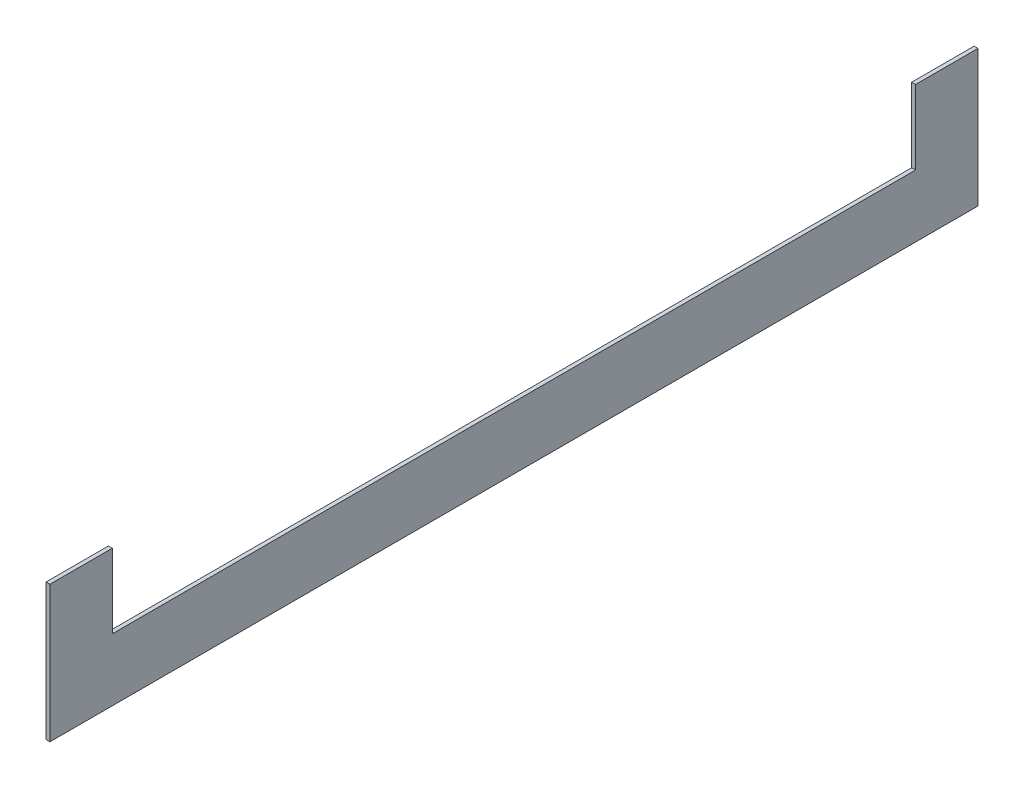
ISO-10303-21;
HEADER;
FILE_DESCRIPTION(('STEP AP214'),'2;1');
FILE_NAME('part.step','',(''),(''),'','','');
FILE_SCHEMA(('AUTOMOTIVE_DESIGN { 1 0 10303 214 1 1 1 1 }'));
ENDSEC;
DATA;
#1=APPLICATION_CONTEXT('core data for automotive mechanical design processes');
#2=APPLICATION_PROTOCOL_DEFINITION('international standard','automotive_design',2000,#1);
#3=PRODUCT_CONTEXT('',#1,'mechanical');
#4=PRODUCT('Part','Part','',(#3));
#5=PRODUCT_RELATED_PRODUCT_CATEGORY('part','',(#4));
#6=PRODUCT_DEFINITION_FORMATION('','',#4);
#7=PRODUCT_DEFINITION_CONTEXT('part definition',#1,'design');
#8=PRODUCT_DEFINITION('design','',#6,#7);
#9=PRODUCT_DEFINITION_SHAPE('','',#8);
#10=(LENGTH_UNIT() NAMED_UNIT(*) SI_UNIT(.MILLI.,.METRE.));
#11=(NAMED_UNIT(*) PLANE_ANGLE_UNIT() SI_UNIT($,.RADIAN.));
#12=(NAMED_UNIT(*) SI_UNIT($,.STERADIAN.) SOLID_ANGLE_UNIT());
#13=UNCERTAINTY_MEASURE_WITH_UNIT(LENGTH_MEASURE(1.E-05),#10,'distance_accuracy_value','');
#14=(GEOMETRIC_REPRESENTATION_CONTEXT(3) GLOBAL_UNCERTAINTY_ASSIGNED_CONTEXT((#13)) GLOBAL_UNIT_ASSIGNED_CONTEXT((#10,
#11,#12)) REPRESENTATION_CONTEXT('',''));
#15=CARTESIAN_POINT('',(0.,0.,0.));
#16=DIRECTION('',(0.,0.,1.));
#17=DIRECTION('',(1.,0.,0.));
#18=AXIS2_PLACEMENT_3D('',#15,#16,#17);
#19=CARTESIAN_POINT('',(3.175,0.,377.825));
#20=DIRECTION('',(0.,0.,-1.));
#21=DIRECTION('',(-1.,0.,0.));
#22=AXIS2_PLACEMENT_3D('',#19,#20,#21);
#23=PLANE('',#22);
#24=DIRECTION('',(0.,-1.,0.));
#25=VECTOR('',#24,1.);
#26=CARTESIAN_POINT('',(0.,0.,377.825));
#27=LINE('',#26,#25);
#28=CARTESIAN_POINT('',(0.,111.125,377.825));
#29=VERTEX_POINT('',#28);
#30=CARTESIAN_POINT('',(0.,0.,377.825));
#31=VERTEX_POINT('',#30);
#32=EDGE_CURVE('E129',#29,#31,#27,.T.);
#33=ORIENTED_EDGE('',*,*,#32,.T.);
#34=DIRECTION('',(-1.,0.,0.));
#35=VECTOR('',#34,1.);
#36=CARTESIAN_POINT('',(3.175,0.,377.825));
#37=LINE('',#36,#35);
#38=CARTESIAN_POINT('',(3.175,0.,377.825));
#39=VERTEX_POINT('',#38);
#40=EDGE_CURVE('E11',#39,#31,#37,.T.);
#41=ORIENTED_EDGE('',*,*,#40,.F.);
#42=DIRECTION('',(0.,-1.,0.));
#43=VECTOR('',#42,1.);
#44=CARTESIAN_POINT('',(3.175,0.,377.825));
#45=LINE('',#44,#43);
#46=CARTESIAN_POINT('',(3.175,111.125,377.825));
#47=VERTEX_POINT('',#46);
#48=EDGE_CURVE('E143',#47,#39,#45,.T.);
#49=ORIENTED_EDGE('',*,*,#48,.F.);
#50=DIRECTION('',(-1.,0.,0.));
#51=VECTOR('',#50,1.);
#52=CARTESIAN_POINT('',(3.175,111.125,377.825));
#53=LINE('',#52,#51);
#54=EDGE_CURVE('E125',#47,#29,#53,.T.);
#55=ORIENTED_EDGE('',*,*,#54,.T.);
#56=EDGE_LOOP('',(#33,#41,#49,#55));
#57=FACE_BOUND('',#56,.T.);
#58=ADVANCED_FACE('F33',(#57),#23,.F.);
#59=CARTESIAN_POINT('',(3.175,0.,377.825));
#60=DIRECTION('',(0.,1.,0.));
#61=DIRECTION('',(0.,0.,1.));
#62=AXIS2_PLACEMENT_3D('',#59,#60,#61);
#63=PLANE('',#62);
#64=DIRECTION('',(0.,0.,-1.));
#65=VECTOR('',#64,1.);
#66=CARTESIAN_POINT('',(0.,0.,377.825));
#67=LINE('',#66,#65);
#68=CARTESIAN_POINT('',(0.,1.3903822314399E-13,-377.825));
#69=VERTEX_POINT('',#68);
#70=EDGE_CURVE('E132',#31,#69,#67,.T.);
#71=ORIENTED_EDGE('',*,*,#70,.T.);
#72=DIRECTION('',(-1.,0.,0.));
#73=VECTOR('',#72,1.);
#74=CARTESIAN_POINT('',(3.175,1.3903822314399E-13,-377.825));
#75=LINE('',#74,#73);
#76=CARTESIAN_POINT('',(3.175,1.3903822314399E-13,-377.825));
#77=VERTEX_POINT('',#76);
#78=EDGE_CURVE('E41',#77,#69,#75,.T.);
#79=ORIENTED_EDGE('',*,*,#78,.F.);
#80=DIRECTION('',(0.,0.,-1.));
#81=VECTOR('',#80,1.);
#82=CARTESIAN_POINT('',(3.175,0.,377.825));
#83=LINE('',#82,#81);
#84=EDGE_CURVE('E92',#39,#77,#83,.T.);
#85=ORIENTED_EDGE('',*,*,#84,.F.);
#86=ORIENTED_EDGE('',*,*,#40,.T.);
#87=EDGE_LOOP('',(#71,#79,#85,#86));
#88=FACE_BOUND('',#87,.T.);
#89=ADVANCED_FACE('F178',(#88),#63,.F.);
#90=CARTESIAN_POINT('',(3.175,111.125,-377.825));
#91=DIRECTION('',(0.,0.,1.));
#92=DIRECTION('',(1.,0.,0.));
#93=AXIS2_PLACEMENT_3D('',#90,#91,#92);
#94=PLANE('',#93);
#95=DIRECTION('',(0.,1.,0.));
#96=VECTOR('',#95,1.);
#97=CARTESIAN_POINT('',(0.,111.125,-377.825));
#98=LINE('',#97,#96);
#99=CARTESIAN_POINT('',(0.,111.125,-377.825));
#100=VERTEX_POINT('',#99);
#101=EDGE_CURVE('E134',#69,#100,#98,.T.);
#102=ORIENTED_EDGE('',*,*,#101,.T.);
#103=DIRECTION('',(-1.,0.,0.));
#104=VECTOR('',#103,1.);
#105=CARTESIAN_POINT('',(3.175,111.125,-377.825));
#106=LINE('',#105,#104);
#107=CARTESIAN_POINT('',(3.175,111.125,-377.825));
#108=VERTEX_POINT('',#107);
#109=EDGE_CURVE('E150',#108,#100,#106,.T.);
#110=ORIENTED_EDGE('',*,*,#109,.F.);
#111=DIRECTION('',(0.,1.,0.));
#112=VECTOR('',#111,1.);
#113=CARTESIAN_POINT('',(3.175,111.125,-377.825));
#114=LINE('',#113,#112);
#115=EDGE_CURVE('E158',#77,#108,#114,.T.);
#116=ORIENTED_EDGE('',*,*,#115,.F.);
#117=ORIENTED_EDGE('',*,*,#78,.T.);
#118=EDGE_LOOP('',(#102,#110,#116,#117));
#119=FACE_BOUND('',#118,.T.);
#120=ADVANCED_FACE('F156',(#119),#94,.F.);
#121=CARTESIAN_POINT('',(3.175,111.125,-327.025));
#122=DIRECTION('',(0.,-1.,0.));
#123=DIRECTION('',(0.,0.,-1.));
#124=AXIS2_PLACEMENT_3D('',#121,#122,#123);
#125=PLANE('',#124);
#126=DIRECTION('',(0.,0.,1.));
#127=VECTOR('',#126,1.);
#128=CARTESIAN_POINT('',(0.,111.125,-327.025));
#129=LINE('',#128,#127);
#130=CARTESIAN_POINT('',(0.,111.125,-327.025));
#131=VERTEX_POINT('',#130);
#132=EDGE_CURVE('E136',#100,#131,#129,.T.);
#133=ORIENTED_EDGE('',*,*,#132,.T.);
#134=DIRECTION('',(-1.,0.,0.));
#135=VECTOR('',#134,1.);
#136=CARTESIAN_POINT('',(3.175,111.125,-327.025));
#137=LINE('',#136,#135);
#138=CARTESIAN_POINT('',(3.175,111.125,-327.025));
#139=VERTEX_POINT('',#138);
#140=EDGE_CURVE('E147',#139,#131,#137,.T.);
#141=ORIENTED_EDGE('',*,*,#140,.F.);
#142=DIRECTION('',(0.,0.,1.));
#143=VECTOR('',#142,1.);
#144=CARTESIAN_POINT('',(3.175,111.125,-327.025));
#145=LINE('',#144,#143);
#146=EDGE_CURVE('E170',#108,#139,#145,.T.);
#147=ORIENTED_EDGE('',*,*,#146,.F.);
#148=ORIENTED_EDGE('',*,*,#109,.T.);
#149=EDGE_LOOP('',(#133,#141,#147,#148));
#150=FACE_BOUND('',#149,.T.);
#151=ADVANCED_FACE('F166',(#150),#125,.F.);
#152=CARTESIAN_POINT('',(3.175,50.8000000000001,-327.025));
#153=DIRECTION('',(0.,0.,-1.));
#154=DIRECTION('',(-1.,0.,0.));
#155=AXIS2_PLACEMENT_3D('',#152,#153,#154);
#156=PLANE('',#155);
#157=DIRECTION('',(0.,-1.,0.));
#158=VECTOR('',#157,1.);
#159=CARTESIAN_POINT('',(0.,50.8000000000001,-327.025));
#160=LINE('',#159,#158);
#161=CARTESIAN_POINT('',(0.,50.8000000000001,-327.025));
#162=VERTEX_POINT('',#161);
#163=EDGE_CURVE('E138',#131,#162,#160,.T.);
#164=ORIENTED_EDGE('',*,*,#163,.T.);
#165=DIRECTION('',(-1.,0.,0.));
#166=VECTOR('',#165,1.);
#167=CARTESIAN_POINT('',(3.175,50.8000000000001,-327.025));
#168=LINE('',#167,#166);
#169=CARTESIAN_POINT('',(3.175,50.8000000000001,-327.025));
#170=VERTEX_POINT('',#169);
#171=EDGE_CURVE('E120',#170,#162,#168,.T.);
#172=ORIENTED_EDGE('',*,*,#171,.F.);
#173=DIRECTION('',(0.,-1.,0.));
#174=VECTOR('',#173,1.);
#175=CARTESIAN_POINT('',(3.175,50.8000000000001,-327.025));
#176=LINE('',#175,#174);
#177=EDGE_CURVE('E111',#139,#170,#176,.T.);
#178=ORIENTED_EDGE('',*,*,#177,.F.);
#179=ORIENTED_EDGE('',*,*,#140,.T.);
#180=EDGE_LOOP('',(#164,#172,#178,#179));
#181=FACE_BOUND('',#180,.T.);
#182=ADVANCED_FACE('F169',(#181),#156,.F.);
#183=CARTESIAN_POINT('',(3.175,50.8,327.025));
#184=DIRECTION('',(0.,-1.,0.));
#185=DIRECTION('',(0.,0.,-1.));
#186=AXIS2_PLACEMENT_3D('',#183,#184,#185);
#187=PLANE('',#186);
#188=DIRECTION('',(0.,0.,1.));
#189=VECTOR('',#188,1.);
#190=CARTESIAN_POINT('',(0.,50.8,327.025));
#191=LINE('',#190,#189);
#192=CARTESIAN_POINT('',(0.,50.8,327.025));
#193=VERTEX_POINT('',#192);
#194=EDGE_CURVE('E119',#162,#193,#191,.T.);
#195=ORIENTED_EDGE('',*,*,#194,.T.);
#196=DIRECTION('',(-1.,0.,0.));
#197=VECTOR('',#196,1.);
#198=CARTESIAN_POINT('',(3.175,50.8,327.025));
#199=LINE('',#198,#197);
#200=CARTESIAN_POINT('',(3.175,50.8,327.025));
#201=VERTEX_POINT('',#200);
#202=EDGE_CURVE('E116',#201,#193,#199,.T.);
#203=ORIENTED_EDGE('',*,*,#202,.F.);
#204=DIRECTION('',(0.,0.,1.));
#205=VECTOR('',#204,1.);
#206=CARTESIAN_POINT('',(3.175,50.8,327.025));
#207=LINE('',#206,#205);
#208=EDGE_CURVE('E105',#170,#201,#207,.T.);
#209=ORIENTED_EDGE('',*,*,#208,.F.);
#210=ORIENTED_EDGE('',*,*,#171,.T.);
#211=EDGE_LOOP('',(#195,#203,#209,#210));
#212=FACE_BOUND('',#211,.T.);
#213=ADVANCED_FACE('F117',(#212),#187,.F.);
#214=CARTESIAN_POINT('',(3.175,111.125,327.025));
#215=DIRECTION('',(0.,0.,1.));
#216=DIRECTION('',(1.,0.,0.));
#217=AXIS2_PLACEMENT_3D('',#214,#215,#216);
#218=PLANE('',#217);
#219=DIRECTION('',(0.,1.,0.));
#220=VECTOR('',#219,1.);
#221=CARTESIAN_POINT('',(0.,111.125,327.025));
#222=LINE('',#221,#220);
#223=CARTESIAN_POINT('',(0.,111.125,327.025));
#224=VERTEX_POINT('',#223);
#225=EDGE_CURVE('E78',#193,#224,#222,.T.);
#226=ORIENTED_EDGE('',*,*,#225,.T.);
#227=DIRECTION('',(-1.,0.,0.));
#228=VECTOR('',#227,1.);
#229=CARTESIAN_POINT('',(3.175,111.125,327.025));
#230=LINE('',#229,#228);
#231=CARTESIAN_POINT('',(3.175,111.125,327.025));
#232=VERTEX_POINT('',#231);
#233=EDGE_CURVE('E121',#232,#224,#230,.T.);
#234=ORIENTED_EDGE('',*,*,#233,.F.);
#235=DIRECTION('',(0.,1.,0.));
#236=VECTOR('',#235,1.);
#237=CARTESIAN_POINT('',(3.175,111.125,327.025));
#238=LINE('',#237,#236);
#239=EDGE_CURVE('E109',#201,#232,#238,.T.);
#240=ORIENTED_EDGE('',*,*,#239,.F.);
#241=ORIENTED_EDGE('',*,*,#202,.T.);
#242=EDGE_LOOP('',(#226,#234,#240,#241));
#243=FACE_BOUND('',#242,.T.);
#244=ADVANCED_FACE('F123',(#243),#218,.F.);
#245=CARTESIAN_POINT('',(3.175,111.125,377.825));
#246=DIRECTION('',(0.,-1.,0.));
#247=DIRECTION('',(0.,0.,-1.));
#248=AXIS2_PLACEMENT_3D('',#245,#246,#247);
#249=PLANE('',#248);
#250=DIRECTION('',(0.,0.,1.));
#251=VECTOR('',#250,1.);
#252=CARTESIAN_POINT('',(0.,111.125,377.825));
#253=LINE('',#252,#251);
#254=EDGE_CURVE('E84',#224,#29,#253,.T.);
#255=ORIENTED_EDGE('',*,*,#254,.T.);
#256=ORIENTED_EDGE('',*,*,#54,.F.);
#257=DIRECTION('',(0.,0.,1.));
#258=VECTOR('',#257,1.);
#259=CARTESIAN_POINT('',(3.175,111.125,377.825));
#260=LINE('',#259,#258);
#261=EDGE_CURVE('E49',#232,#47,#260,.T.);
#262=ORIENTED_EDGE('',*,*,#261,.F.);
#263=ORIENTED_EDGE('',*,*,#233,.T.);
#264=EDGE_LOOP('',(#255,#256,#262,#263));
#265=FACE_BOUND('',#264,.T.);
#266=ADVANCED_FACE('F194',(#265),#249,.F.);
#267=CARTESIAN_POINT('',(3.175,0.,0.));
#268=DIRECTION('',(-1.,0.,0.));
#269=DIRECTION('',(0.,0.,1.));
#270=AXIS2_PLACEMENT_3D('',#267,#268,#269);
#271=PLANE('',#270);
#272=ORIENTED_EDGE('',*,*,#48,.T.);
#273=ORIENTED_EDGE('',*,*,#84,.T.);
#274=ORIENTED_EDGE('',*,*,#115,.T.);
#275=ORIENTED_EDGE('',*,*,#146,.T.);
#276=ORIENTED_EDGE('',*,*,#177,.T.);
#277=ORIENTED_EDGE('',*,*,#208,.T.);
#278=ORIENTED_EDGE('',*,*,#239,.T.);
#279=ORIENTED_EDGE('',*,*,#261,.T.);
#280=EDGE_LOOP('',(#272,#273,#274,#275,#276,#277,#278,#279));
#281=FACE_BOUND('',#280,.T.);
#282=ADVANCED_FACE('F107',(#281),#271,.F.);
#283=CARTESIAN_POINT('',(0.,0.,0.));
#284=DIRECTION('',(-1.,0.,0.));
#285=DIRECTION('',(0.,0.,1.));
#286=AXIS2_PLACEMENT_3D('',#283,#284,#285);
#287=PLANE('',#286);
#288=ORIENTED_EDGE('',*,*,#32,.F.);
#289=ORIENTED_EDGE('',*,*,#254,.F.);
#290=ORIENTED_EDGE('',*,*,#225,.F.);
#291=ORIENTED_EDGE('',*,*,#194,.F.);
#292=ORIENTED_EDGE('',*,*,#163,.F.);
#293=ORIENTED_EDGE('',*,*,#132,.F.);
#294=ORIENTED_EDGE('',*,*,#101,.F.);
#295=ORIENTED_EDGE('',*,*,#70,.F.);
#296=EDGE_LOOP('',(#288,#289,#290,#291,#292,#293,#294,#295));
#297=FACE_BOUND('',#296,.T.);
#298=ADVANCED_FACE('F162',(#297),#287,.T.);
#299=CLOSED_SHELL('',(#58,#89,#120,#151,#182,#213,#244,#266,#282,#298));
#300=MANIFOLD_SOLID_BREP('B2',#299);
#301=ADVANCED_BREP_SHAPE_REPRESENTATION('',(#18,#300),#14);
#302=SHAPE_DEFINITION_REPRESENTATION(#9,#301);
ENDSEC;
END-ISO-10303-21;
